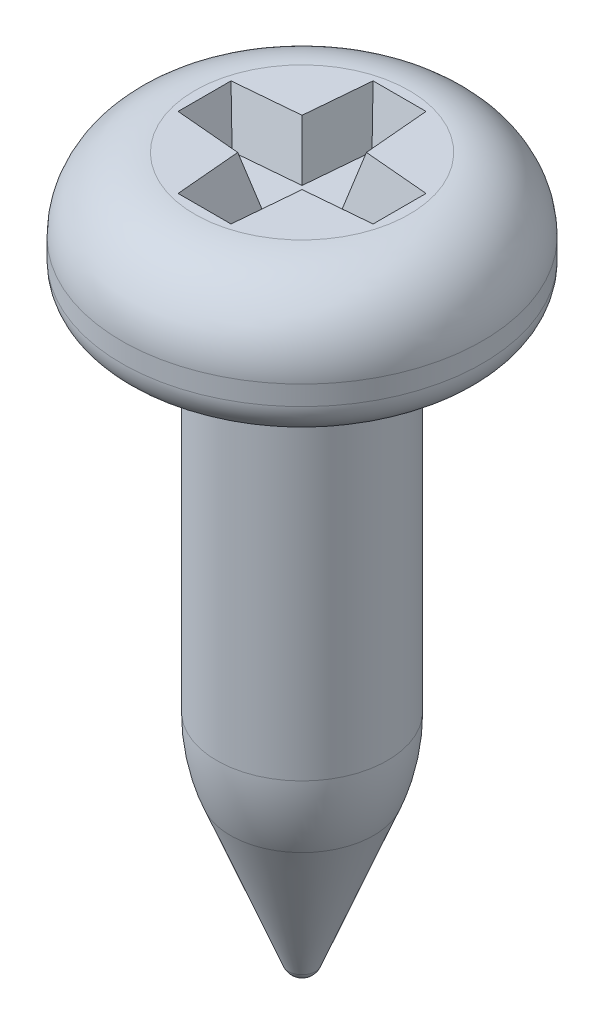
ISO-10303-21;
HEADER;
FILE_DESCRIPTION(('STEP AP214'),'2;1');
FILE_NAME('part.step','',(''),(''),'','','');
FILE_SCHEMA(('AUTOMOTIVE_DESIGN { 1 0 10303 214 1 1 1 1 }'));
ENDSEC;
DATA;
#1=APPLICATION_CONTEXT('core data for automotive mechanical design processes');
#2=APPLICATION_PROTOCOL_DEFINITION('international standard','automotive_design',2000,#1);
#3=PRODUCT_CONTEXT('',#1,'mechanical');
#4=PRODUCT('Part','Part','',(#3));
#5=PRODUCT_RELATED_PRODUCT_CATEGORY('part','',(#4));
#6=PRODUCT_DEFINITION_FORMATION('','',#4);
#7=PRODUCT_DEFINITION_CONTEXT('part definition',#1,'design');
#8=PRODUCT_DEFINITION('design','',#6,#7);
#9=PRODUCT_DEFINITION_SHAPE('','',#8);
#10=(LENGTH_UNIT() NAMED_UNIT(*) SI_UNIT(.MILLI.,.METRE.));
#11=(NAMED_UNIT(*) PLANE_ANGLE_UNIT() SI_UNIT($,.RADIAN.));
#12=(NAMED_UNIT(*) SI_UNIT($,.STERADIAN.) SOLID_ANGLE_UNIT());
#13=UNCERTAINTY_MEASURE_WITH_UNIT(LENGTH_MEASURE(1.E-05),#10,'distance_accuracy_value','');
#14=(GEOMETRIC_REPRESENTATION_CONTEXT(3) GLOBAL_UNCERTAINTY_ASSIGNED_CONTEXT((#13)) GLOBAL_UNIT_ASSIGNED_CONTEXT((#10,
#11,#12)) REPRESENTATION_CONTEXT('',''));
#15=CARTESIAN_POINT('',(0.,0.,0.));
#16=DIRECTION('',(0.,0.,1.));
#17=DIRECTION('',(1.,0.,0.));
#18=AXIS2_PLACEMENT_3D('',#15,#16,#17);
#19=CARTESIAN_POINT('',(1.1,0.,0.));
#20=DIRECTION('',(0.,-1.,0.));
#21=DIRECTION('',(1.,0.,0.));
#22=AXIS2_PLACEMENT_3D('',#19,#20,#21);
#23=PLANE('',#22);
#24=DIRECTION('',(-1.,0.,0.));
#25=VECTOR('',#24,1.);
#26=CARTESIAN_POINT('',(-0.271382595437633,0.,-1.));
#27=LINE('',#26,#25);
#28=CARTESIAN_POINT('',(0.271382595437633,0.,-1.));
#29=VERTEX_POINT('',#28);
#30=CARTESIAN_POINT('',(-0.271382595437633,0.,-1.));
#31=VERTEX_POINT('',#30);
#32=EDGE_CURVE('E139',#29,#31,#27,.T.);
#33=ORIENTED_EDGE('',*,*,#32,.F.);
#34=DIRECTION('',(-0.0871557427476548,0.,-0.996194698091746));
#35=VECTOR('',#34,1.);
#36=CARTESIAN_POINT('',(0.271382595437633,0.,-1.));
#37=LINE('',#36,#35);
#38=CARTESIAN_POINT('',(0.33,0.,-0.33));
#39=VERTEX_POINT('',#38);
#40=EDGE_CURVE('E47',#39,#29,#37,.T.);
#41=ORIENTED_EDGE('',*,*,#40,.F.);
#42=DIRECTION('',(-0.996194698091746,0.,-0.0871557427476548));
#43=VECTOR('',#42,1.);
#44=CARTESIAN_POINT('',(0.33,0.,-0.33));
#45=LINE('',#44,#43);
#46=CARTESIAN_POINT('',(1.,0.,-0.271382595437633));
#47=VERTEX_POINT('',#46);
#48=EDGE_CURVE('E171',#47,#39,#45,.T.);
#49=ORIENTED_EDGE('',*,*,#48,.F.);
#50=DIRECTION('',(0.,0.,-1.));
#51=VECTOR('',#50,1.);
#52=CARTESIAN_POINT('',(1.,0.,-0.271382595437633));
#53=LINE('',#52,#51);
#54=CARTESIAN_POINT('',(1.,0.,0.271382595437633));
#55=VERTEX_POINT('',#54);
#56=EDGE_CURVE('E169',#55,#47,#53,.T.);
#57=ORIENTED_EDGE('',*,*,#56,.F.);
#58=DIRECTION('',(0.996194698091746,0.,-0.0871557427476548));
#59=VECTOR('',#58,1.);
#60=CARTESIAN_POINT('',(0.33,0.,0.33));
#61=LINE('',#60,#59);
#62=CARTESIAN_POINT('',(0.33,0.,0.33));
#63=VERTEX_POINT('',#62);
#64=EDGE_CURVE('E166',#63,#55,#61,.T.);
#65=ORIENTED_EDGE('',*,*,#64,.F.);
#66=DIRECTION('',(0.0871557427476548,0.,-0.996194698091746));
#67=VECTOR('',#66,1.);
#68=CARTESIAN_POINT('',(0.271382595437633,0.,1.));
#69=LINE('',#68,#67);
#70=CARTESIAN_POINT('',(0.271382595437633,0.,1.));
#71=VERTEX_POINT('',#70);
#72=EDGE_CURVE('E163',#71,#63,#69,.T.);
#73=ORIENTED_EDGE('',*,*,#72,.F.);
#74=DIRECTION('',(1.,0.,0.));
#75=VECTOR('',#74,1.);
#76=CARTESIAN_POINT('',(-0.271382595437633,0.,1.));
#77=LINE('',#76,#75);
#78=CARTESIAN_POINT('',(-0.271382595437633,0.,1.));
#79=VERTEX_POINT('',#78);
#80=EDGE_CURVE('E160',#79,#71,#77,.T.);
#81=ORIENTED_EDGE('',*,*,#80,.F.);
#82=DIRECTION('',(0.0871557427476548,0.,0.996194698091746));
#83=VECTOR('',#82,1.);
#84=CARTESIAN_POINT('',(-0.271382595437633,0.,1.));
#85=LINE('',#84,#83);
#86=CARTESIAN_POINT('',(-0.33,0.,0.33));
#87=VERTEX_POINT('',#86);
#88=EDGE_CURVE('E157',#87,#79,#85,.T.);
#89=ORIENTED_EDGE('',*,*,#88,.F.);
#90=DIRECTION('',(0.996194698091746,0.,0.0871557427476548));
#91=VECTOR('',#90,1.);
#92=CARTESIAN_POINT('',(-0.33,0.,0.33));
#93=LINE('',#92,#91);
#94=CARTESIAN_POINT('',(-1.,0.,0.271382595437633));
#95=VERTEX_POINT('',#94);
#96=EDGE_CURVE('E154',#95,#87,#93,.T.);
#97=ORIENTED_EDGE('',*,*,#96,.F.);
#98=DIRECTION('',(0.,0.,1.));
#99=VECTOR('',#98,1.);
#100=CARTESIAN_POINT('',(-1.,0.,-0.271382595437633));
#101=LINE('',#100,#99);
#102=CARTESIAN_POINT('',(-1.,0.,-0.271382595437633));
#103=VERTEX_POINT('',#102);
#104=EDGE_CURVE('E148',#103,#95,#101,.T.);
#105=ORIENTED_EDGE('',*,*,#104,.F.);
#106=DIRECTION('',(-0.996194698091746,0.,0.0871557427476548));
#107=VECTOR('',#106,1.);
#108=CARTESIAN_POINT('',(-0.33,0.,-0.33));
#109=LINE('',#108,#107);
#110=CARTESIAN_POINT('',(-0.33,0.,-0.33));
#111=VERTEX_POINT('',#110);
#112=EDGE_CURVE('E146',#111,#103,#109,.T.);
#113=ORIENTED_EDGE('',*,*,#112,.F.);
#114=DIRECTION('',(-0.0871557427476548,0.,0.996194698091746));
#115=VECTOR('',#114,1.);
#116=CARTESIAN_POINT('',(-0.271382595437633,0.,-1.));
#117=LINE('',#116,#115);
#118=EDGE_CURVE('E130',#31,#111,#117,.T.);
#119=ORIENTED_EDGE('',*,*,#118,.F.);
#120=EDGE_LOOP('',(#33,#41,#49,#57,#65,#73,#81,#89,#97,#105,#113,#119));
#121=FACE_BOUND('',#120,.T.);
#122=CARTESIAN_POINT('',(0.,0.,0.));
#123=DIRECTION('',(0.,1.,0.));
#124=DIRECTION('',(-1.,0.,0.));
#125=AXIS2_PLACEMENT_3D('',#122,#123,#124);
#126=CIRCLE('',#125,1.1);
#127=CARTESIAN_POINT('',(-1.1,0.,0.));
#128=VERTEX_POINT('',#127);
#129=EDGE_CURVE('E11',#128,#128,#126,.T.);
#130=ORIENTED_EDGE('',*,*,#129,.T.);
#131=EDGE_LOOP('',(#130));
#132=FACE_BOUND('',#131,.T.);
#133=ADVANCED_FACE('F33',(#121,#132),#23,.F.);
#134=CARTESIAN_POINT('',(0.,-0.75,0.));
#135=DIRECTION('',(0.,1.,0.));
#136=DIRECTION('',(-1.,0.,0.));
#137=AXIS2_PLACEMENT_3D('',#134,#135,#136);
#138=TOROIDAL_SURFACE('',#137,1.1,0.75);
#139=ORIENTED_EDGE('',*,*,#129,.F.);
#140=EDGE_LOOP('',(#139));
#141=FACE_BOUND('',#140,.T.);
#142=CARTESIAN_POINT('',(0.,-0.75,0.));
#143=DIRECTION('',(0.,1.,0.));
#144=DIRECTION('',(-1.,0.,0.));
#145=AXIS2_PLACEMENT_3D('',#142,#143,#144);
#146=CIRCLE('',#145,1.85);
#147=CARTESIAN_POINT('',(-1.85,-0.750000000000001,0.));
#148=VERTEX_POINT('',#147);
#149=EDGE_CURVE('E40',#148,#148,#146,.T.);
#150=ORIENTED_EDGE('',*,*,#149,.T.);
#151=EDGE_LOOP('',(#150));
#152=FACE_BOUND('',#151,.T.);
#153=ADVANCED_FACE('F247',(#141,#152),#138,.T.);
#154=CARTESIAN_POINT('',(0.,0.,0.));
#155=DIRECTION('',(0.,1.,0.));
#156=DIRECTION('',(-1.,0.,0.));
#157=AXIS2_PLACEMENT_3D('',#154,#155,#156);
#158=CYLINDRICAL_SURFACE('',#157,1.85);
#159=ORIENTED_EDGE('',*,*,#149,.F.);
#160=EDGE_LOOP('',(#159));
#161=FACE_BOUND('',#160,.T.);
#162=CARTESIAN_POINT('',(0.,-0.95,0.));
#163=DIRECTION('',(0.,1.,0.));
#164=DIRECTION('',(-1.,0.,0.));
#165=AXIS2_PLACEMENT_3D('',#162,#163,#164);
#166=CIRCLE('',#165,1.85);
#167=CARTESIAN_POINT('',(-1.85,-0.950000000000001,0.));
#168=VERTEX_POINT('',#167);
#169=EDGE_CURVE('E242',#168,#168,#166,.T.);
#170=ORIENTED_EDGE('',*,*,#169,.T.);
#171=EDGE_LOOP('',(#170));
#172=FACE_BOUND('',#171,.T.);
#173=ADVANCED_FACE('F249',(#161,#172),#158,.T.);
#174=CARTESIAN_POINT('',(0.,-0.95,0.));
#175=DIRECTION('',(0.,1.,0.));
#176=DIRECTION('',(-1.,0.,0.));
#177=AXIS2_PLACEMENT_3D('',#174,#175,#176);
#178=TOROIDAL_SURFACE('',#177,1.5,0.35);
#179=ORIENTED_EDGE('',*,*,#169,.F.);
#180=EDGE_LOOP('',(#179));
#181=FACE_BOUND('',#180,.T.);
#182=CARTESIAN_POINT('',(0.,-1.3,0.));
#183=DIRECTION('',(0.,1.,0.));
#184=DIRECTION('',(-1.,0.,0.));
#185=AXIS2_PLACEMENT_3D('',#182,#183,#184);
#186=CIRCLE('',#185,1.5);
#187=CARTESIAN_POINT('',(-1.5,-1.3,0.));
#188=VERTEX_POINT('',#187);
#189=EDGE_CURVE('E239',#188,#188,#186,.T.);
#190=ORIENTED_EDGE('',*,*,#189,.T.);
#191=EDGE_LOOP('',(#190));
#192=FACE_BOUND('',#191,.T.);
#193=ADVANCED_FACE('F252',(#181,#192),#178,.T.);
#194=CARTESIAN_POINT('',(1.025,-1.3,0.));
#195=DIRECTION('',(0.,1.,0.));
#196=DIRECTION('',(-1.,0.,0.));
#197=AXIS2_PLACEMENT_3D('',#194,#195,#196);
#198=PLANE('',#197);
#199=ORIENTED_EDGE('',*,*,#189,.F.);
#200=EDGE_LOOP('',(#199));
#201=FACE_BOUND('',#200,.T.);
#202=CARTESIAN_POINT('',(0.,-1.3,0.));
#203=DIRECTION('',(0.,1.,0.));
#204=DIRECTION('',(-1.,0.,0.));
#205=AXIS2_PLACEMENT_3D('',#202,#203,#204);
#206=CIRCLE('',#205,1.025);
#207=CARTESIAN_POINT('',(-1.025,-1.3,0.));
#208=VERTEX_POINT('',#207);
#209=EDGE_CURVE('E236',#208,#208,#206,.T.);
#210=ORIENTED_EDGE('',*,*,#209,.T.);
#211=EDGE_LOOP('',(#210));
#212=FACE_BOUND('',#211,.T.);
#213=ADVANCED_FACE('F258',(#201,#212),#198,.F.);
#214=CARTESIAN_POINT('',(0.,-1.45,0.));
#215=DIRECTION('',(0.,1.,0.));
#216=DIRECTION('',(-1.,0.,0.));
#217=AXIS2_PLACEMENT_3D('',#214,#215,#216);
#218=TOROIDAL_SURFACE('',#217,1.025,0.15);
#219=ORIENTED_EDGE('',*,*,#209,.F.);
#220=EDGE_LOOP('',(#219));
#221=FACE_BOUND('',#220,.T.);
#222=CARTESIAN_POINT('',(0.,-1.45,0.));
#223=DIRECTION('',(0.,1.,0.));
#224=DIRECTION('',(-1.,0.,0.));
#225=AXIS2_PLACEMENT_3D('',#222,#223,#224);
#226=CIRCLE('',#225,0.874999999999999);
#227=CARTESIAN_POINT('',(-0.874999999999999,-1.45,0.));
#228=VERTEX_POINT('',#227);
#229=EDGE_CURVE('E233',#228,#228,#226,.T.);
#230=ORIENTED_EDGE('',*,*,#229,.T.);
#231=EDGE_LOOP('',(#230));
#232=FACE_BOUND('',#231,.T.);
#233=ADVANCED_FACE('F264',(#221,#232),#218,.F.);
#234=CARTESIAN_POINT('',(0.,0.,0.));
#235=DIRECTION('',(0.,1.,0.));
#236=DIRECTION('',(-1.,0.,0.));
#237=AXIS2_PLACEMENT_3D('',#234,#235,#236);
#238=CYLINDRICAL_SURFACE('',#237,0.875);
#239=ORIENTED_EDGE('',*,*,#229,.F.);
#240=EDGE_LOOP('',(#239));
#241=FACE_BOUND('',#240,.T.);
#242=CARTESIAN_POINT('',(0.,-4.96440542344636,0.));
#243=DIRECTION('',(0.,1.,0.));
#244=DIRECTION('',(-1.,0.,0.));
#245=AXIS2_PLACEMENT_3D('',#242,#243,#244);
#246=CIRCLE('',#245,0.875);
#247=CARTESIAN_POINT('',(-0.874999999999999,-4.96440542344636,0.));
#248=VERTEX_POINT('',#247);
#249=EDGE_CURVE('E230',#248,#248,#246,.T.);
#250=ORIENTED_EDGE('',*,*,#249,.T.);
#251=EDGE_LOOP('',(#250));
#252=FACE_BOUND('',#251,.T.);
#253=ADVANCED_FACE('F270',(#241,#252),#238,.T.);
#254=CARTESIAN_POINT('',(0.,-4.96440542344636,0.));
#255=DIRECTION('',(0.,1.,0.));
#256=DIRECTION('',(-1.,0.,0.));
#257=AXIS2_PLACEMENT_3D('',#254,#255,#256);
#258=DEGENERATE_TOROIDAL_SURFACE('',#257,1.125,2.,.F.);
#259=ORIENTED_EDGE('',*,*,#249,.F.);
#260=EDGE_LOOP('',(#259));
#261=FACE_BOUND('',#260,.T.);
#262=CARTESIAN_POINT('',(0.,-5.7,0.));
#263=DIRECTION('',(0.,1.,0.));
#264=DIRECTION('',(-1.,0.,0.));
#265=AXIS2_PLACEMENT_3D('',#262,#263,#264);
#266=CIRCLE('',#265,0.73481198483741);
#267=CARTESIAN_POINT('',(-0.734811984837409,-5.7,0.));
#268=VERTEX_POINT('',#267);
#269=EDGE_CURVE('E227',#268,#268,#266,.T.);
#270=ORIENTED_EDGE('',*,*,#269,.T.);
#271=EDGE_LOOP('',(#270));
#272=FACE_BOUND('',#271,.T.);
#273=ADVANCED_FACE('F276',(#261,#272),#258,.F.);
#274=CARTESIAN_POINT('',(0.,-7.20516959324152,0.));
#275=DIRECTION('',(0.,1.,0.));
#276=DIRECTION('',(-1.,0.,0.));
#277=AXIS2_PLACEMENT_3D('',#274,#275,#276);
#278=CONICAL_SURFACE('',#277,0.139485898862805,0.376639161138822);
#279=ORIENTED_EDGE('',*,*,#269,.F.);
#280=EDGE_LOOP('',(#279));
#281=FACE_BOUND('',#280,.T.);
#282=CARTESIAN_POINT('',(0.,-7.20516959324152,0.));
#283=DIRECTION('',(0.,1.,0.));
#284=DIRECTION('',(-1.,0.,0.));
#285=AXIS2_PLACEMENT_3D('',#282,#283,#284);
#286=CIRCLE('',#285,0.139485898862805);
#287=CARTESIAN_POINT('',(-0.139485898862804,-7.20516959324152,0.));
#288=VERTEX_POINT('',#287);
#289=EDGE_CURVE('E175',#288,#288,#286,.T.);
#290=ORIENTED_EDGE('',*,*,#289,.T.);
#291=EDGE_LOOP('',(#290));
#292=FACE_BOUND('',#291,.T.);
#293=ADVANCED_FACE('F282',(#281,#292),#278,.T.);
#294=CARTESIAN_POINT('',(0.,-7.15,0.));
#295=DIRECTION('',(0.,1.,0.));
#296=DIRECTION('',(-1.,0.,0.));
#297=AXIS2_PLACEMENT_3D('',#294,#295,#296);
#298=SPHERICAL_SURFACE('',#297,0.149999999999999);
#299=ORIENTED_EDGE('',*,*,#289,.F.);
#300=EDGE_LOOP('',(#299));
#301=FACE_BOUND('',#300,.T.);
#302=ADVANCED_FACE('F288',(#301),#298,.T.);
#303=CARTESIAN_POINT('',(0.271382595437633,0.,-1.));
#304=DIRECTION('',(0.962250186899058,-0.258819045102521,-0.0841859828293659));
#305=DIRECTION('',(0.259741110692871,0.965678287741851,0.));
#306=AXIS2_PLACEMENT_3D('',#303,#304,#305);
#307=PLANE('',#306);
#308=ORIENTED_EDGE('',*,*,#40,.T.);
#309=DIRECTION('',(0.230762906723662,0.939855498552101,-0.251833521838986));
#310=VECTOR('',#309,1.);
#311=CARTESIAN_POINT('',(0.271382595437633,0.,-1.));
#312=LINE('',#311,#310);
#313=CARTESIAN_POINT('',(0.148617496398917,-0.5,-0.866025403784438));
#314=VERTEX_POINT('',#313);
#315=EDGE_CURVE('E90',#314,#29,#312,.T.);
#316=ORIENTED_EDGE('',*,*,#315,.F.);
#317=DIRECTION('',(-0.0871557427476548,0.,-0.996194698091746));
#318=VECTOR('',#317,1.);
#319=CARTESIAN_POINT('',(0.222680446133132,-0.5,-0.0194820146255435));
#320=LINE('',#319,#318);
#321=CARTESIAN_POINT('',(0.206333094846248,-0.5,-0.206333094846248));
#322=VERTEX_POINT('',#321);
#323=EDGE_CURVE('E173',#322,#314,#320,.T.);
#324=ORIENTED_EDGE('',*,*,#323,.F.);
#325=DIRECTION('',(0.233463888260859,0.943922256203466,-0.233463888260859));
#326=VECTOR('',#325,1.);
#327=CARTESIAN_POINT('',(0.363323645043907,0.134731458681192,-0.363323645043907));
#328=LINE('',#327,#326);
#329=EDGE_CURVE('E55',#322,#39,#328,.T.);
#330=ORIENTED_EDGE('',*,*,#329,.T.);
#331=EDGE_LOOP('',(#308,#316,#324,#330));
#332=FACE_BOUND('',#331,.T.);
#333=ADVANCED_FACE('F293',(#332),#307,.F.);
#334=CARTESIAN_POINT('',(0.33,0.,-0.33));
#335=DIRECTION('',(0.0841859828293659,-0.258819045102521,-0.962250186899058));
#336=DIRECTION('',(0.,0.965678287741851,-0.259741110692871));
#337=AXIS2_PLACEMENT_3D('',#334,#335,#336);
#338=PLANE('',#337);
#339=ORIENTED_EDGE('',*,*,#48,.T.);
#340=ORIENTED_EDGE('',*,*,#329,.F.);
#341=DIRECTION('',(-0.996194698091746,0.,-0.0871557427476548));
#342=VECTOR('',#341,1.);
#343=CARTESIAN_POINT('',(0.0194820146255435,-0.5,-0.222680446133132));
#344=LINE('',#343,#342);
#345=CARTESIAN_POINT('',(0.866025403784438,-0.5,-0.148617496398917));
#346=VERTEX_POINT('',#345);
#347=EDGE_CURVE('E176',#346,#322,#344,.T.);
#348=ORIENTED_EDGE('',*,*,#347,.F.);
#349=DIRECTION('',(0.251833521838986,0.939855498552101,-0.230762906723662));
#350=VECTOR('',#349,1.);
#351=CARTESIAN_POINT('',(1.,0.,-0.271382595437633));
#352=LINE('',#351,#350);
#353=EDGE_CURVE('E95',#346,#47,#352,.T.);
#354=ORIENTED_EDGE('',*,*,#353,.T.);
#355=EDGE_LOOP('',(#339,#340,#348,#354));
#356=FACE_BOUND('',#355,.T.);
#357=ADVANCED_FACE('F298',(#356),#338,.F.);
#358=CARTESIAN_POINT('',(1.,0.,-0.271382595437633));
#359=DIRECTION('',(0.965925826289068,-0.258819045102521,0.));
#360=DIRECTION('',(0.258819045102521,0.965925826289068,0.));
#361=AXIS2_PLACEMENT_3D('',#358,#359,#360);
#362=PLANE('',#361);
#363=ORIENTED_EDGE('',*,*,#56,.T.);
#364=ORIENTED_EDGE('',*,*,#353,.F.);
#365=DIRECTION('',(0.,0.,-1.));
#366=VECTOR('',#365,1.);
#367=CARTESIAN_POINT('',(0.866025403784438,-0.5,0.));
#368=LINE('',#367,#366);
#369=CARTESIAN_POINT('',(0.866025403784438,-0.5,0.148617496398917));
#370=VERTEX_POINT('',#369);
#371=EDGE_CURVE('E199',#370,#346,#368,.T.);
#372=ORIENTED_EDGE('',*,*,#371,.F.);
#373=DIRECTION('',(0.251833521838986,0.939855498552101,0.230762906723662));
#374=VECTOR('',#373,1.);
#375=CARTESIAN_POINT('',(0.960914999983138,-0.145867205876761,0.23556779148571));
#376=LINE('',#375,#374);
#377=EDGE_CURVE('E191',#370,#55,#376,.T.);
#378=ORIENTED_EDGE('',*,*,#377,.T.);
#379=EDGE_LOOP('',(#363,#364,#372,#378));
#380=FACE_BOUND('',#379,.T.);
#381=ADVANCED_FACE('F360',(#380),#362,.F.);
#382=CARTESIAN_POINT('',(0.33,0.,0.33));
#383=DIRECTION('',(0.0841859828293659,-0.258819045102521,0.962250186899058));
#384=DIRECTION('',(0.,-0.965678287741851,-0.259741110692871));
#385=AXIS2_PLACEMENT_3D('',#382,#383,#384);
#386=PLANE('',#385);
#387=ORIENTED_EDGE('',*,*,#64,.T.);
#388=ORIENTED_EDGE('',*,*,#377,.F.);
#389=DIRECTION('',(0.996194698091746,0.,-0.0871557427476548));
#390=VECTOR('',#389,1.);
#391=CARTESIAN_POINT('',(0.0194820146255435,-0.5,0.222680446133132));
#392=LINE('',#391,#390);
#393=CARTESIAN_POINT('',(0.206333094846248,-0.5,0.206333094846248));
#394=VERTEX_POINT('',#393);
#395=EDGE_CURVE('E202',#394,#370,#392,.T.);
#396=ORIENTED_EDGE('',*,*,#395,.F.);
#397=DIRECTION('',(0.233463888260859,0.943922256203466,0.233463888260859));
#398=VECTOR('',#397,1.);
#399=CARTESIAN_POINT('',(0.33,0.,0.33));
#400=LINE('',#399,#398);
#401=EDGE_CURVE('E189',#394,#63,#400,.T.);
#402=ORIENTED_EDGE('',*,*,#401,.T.);
#403=EDGE_LOOP('',(#387,#388,#396,#402));
#404=FACE_BOUND('',#403,.T.);
#405=ADVANCED_FACE('F368',(#404),#386,.F.);
#406=CARTESIAN_POINT('',(0.271382595437633,0.,1.));
#407=DIRECTION('',(0.962250186899058,-0.258819045102521,0.0841859828293659));
#408=DIRECTION('',(0.259741110692871,0.965678287741851,0.));
#409=AXIS2_PLACEMENT_3D('',#406,#407,#408);
#410=PLANE('',#409);
#411=ORIENTED_EDGE('',*,*,#72,.T.);
#412=ORIENTED_EDGE('',*,*,#401,.F.);
#413=DIRECTION('',(0.0871557427476548,0.,-0.996194698091746));
#414=VECTOR('',#413,1.);
#415=CARTESIAN_POINT('',(0.222680446133132,-0.5,0.0194820146255435));
#416=LINE('',#415,#414);
#417=CARTESIAN_POINT('',(0.148617496398917,-0.5,0.866025403784438));
#418=VERTEX_POINT('',#417);
#419=EDGE_CURVE('E205',#418,#394,#416,.T.);
#420=ORIENTED_EDGE('',*,*,#419,.F.);
#421=DIRECTION('',(0.230762906723662,0.939855498552101,0.251833521838986));
#422=VECTOR('',#421,1.);
#423=CARTESIAN_POINT('',(0.242479524498311,-0.117716969910997,0.968457832976909));
#424=LINE('',#423,#422);
#425=EDGE_CURVE('E187',#418,#71,#424,.T.);
#426=ORIENTED_EDGE('',*,*,#425,.T.);
#427=EDGE_LOOP('',(#411,#412,#420,#426));
#428=FACE_BOUND('',#427,.T.);
#429=ADVANCED_FACE('F378',(#428),#410,.F.);
#430=CARTESIAN_POINT('',(-0.271382595437633,0.,1.));
#431=DIRECTION('',(0.,-0.258819045102521,0.965925826289068));
#432=DIRECTION('',(0.,-0.965925826289068,-0.258819045102521));
#433=AXIS2_PLACEMENT_3D('',#430,#431,#432);
#434=PLANE('',#433);
#435=ORIENTED_EDGE('',*,*,#80,.T.);
#436=ORIENTED_EDGE('',*,*,#425,.F.);
#437=DIRECTION('',(1.,0.,0.));
#438=VECTOR('',#437,1.);
#439=CARTESIAN_POINT('',(0.,-0.5,0.866025403784438));
#440=LINE('',#439,#438);
#441=CARTESIAN_POINT('',(-0.148617496398917,-0.5,0.866025403784438));
#442=VERTEX_POINT('',#441);
#443=EDGE_CURVE('E208',#442,#418,#440,.T.);
#444=ORIENTED_EDGE('',*,*,#443,.F.);
#445=DIRECTION('',(-0.230762906723662,0.939855498552101,0.251833521838986));
#446=VECTOR('',#445,1.);
#447=CARTESIAN_POINT('',(-0.271382595437633,0.,1.));
#448=LINE('',#447,#446);
#449=EDGE_CURVE('E185',#442,#79,#448,.T.);
#450=ORIENTED_EDGE('',*,*,#449,.T.);
#451=EDGE_LOOP('',(#435,#436,#444,#450));
#452=FACE_BOUND('',#451,.T.);
#453=ADVANCED_FACE('F388',(#452),#434,.F.);
#454=CARTESIAN_POINT('',(-0.271382595437633,0.,1.));
#455=DIRECTION('',(-0.962250186899058,-0.258819045102521,0.0841859828293659));
#456=DIRECTION('',(0.259741110692871,-0.965678287741851,0.));
#457=AXIS2_PLACEMENT_3D('',#454,#455,#456);
#458=PLANE('',#457);
#459=ORIENTED_EDGE('',*,*,#88,.T.);
#460=ORIENTED_EDGE('',*,*,#449,.F.);
#461=DIRECTION('',(0.0871557427476548,0.,0.996194698091746));
#462=VECTOR('',#461,1.);
#463=CARTESIAN_POINT('',(-0.222680446133132,-0.5,0.0194820146255435));
#464=LINE('',#463,#462);
#465=CARTESIAN_POINT('',(-0.206333094846248,-0.5,0.206333094846248));
#466=VERTEX_POINT('',#465);
#467=EDGE_CURVE('E211',#466,#442,#464,.T.);
#468=ORIENTED_EDGE('',*,*,#467,.F.);
#469=DIRECTION('',(-0.23346388826086,0.943922256203466,0.233463888260859));
#470=VECTOR('',#469,1.);
#471=CARTESIAN_POINT('',(-0.363323645043907,0.134731458681192,0.363323645043907));
#472=LINE('',#471,#470);
#473=EDGE_CURVE('E183',#466,#87,#472,.T.);
#474=ORIENTED_EDGE('',*,*,#473,.T.);
#475=EDGE_LOOP('',(#459,#460,#468,#474));
#476=FACE_BOUND('',#475,.T.);
#477=ADVANCED_FACE('F398',(#476),#458,.F.);
#478=CARTESIAN_POINT('',(-0.33,0.,0.33));
#479=DIRECTION('',(-0.0841859828293659,-0.258819045102521,0.962250186899058));
#480=DIRECTION('',(0.,-0.965678287741851,-0.259741110692871));
#481=AXIS2_PLACEMENT_3D('',#478,#479,#480);
#482=PLANE('',#481);
#483=ORIENTED_EDGE('',*,*,#96,.T.);
#484=ORIENTED_EDGE('',*,*,#473,.F.);
#485=DIRECTION('',(0.996194698091746,0.,0.0871557427476548));
#486=VECTOR('',#485,1.);
#487=CARTESIAN_POINT('',(-0.0194820146255434,-0.5,0.222680446133132));
#488=LINE('',#487,#486);
#489=CARTESIAN_POINT('',(-0.866025403784438,-0.5,0.148617496398917));
#490=VERTEX_POINT('',#489);
#491=EDGE_CURVE('E214',#490,#466,#488,.T.);
#492=ORIENTED_EDGE('',*,*,#491,.F.);
#493=DIRECTION('',(-0.251833521838987,0.939855498552101,0.230762906723662));
#494=VECTOR('',#493,1.);
#495=CARTESIAN_POINT('',(-0.968457832976909,-0.117716969910997,0.242479524498311));
#496=LINE('',#495,#494);
#497=EDGE_CURVE('E181',#490,#95,#496,.T.);
#498=ORIENTED_EDGE('',*,*,#497,.T.);
#499=EDGE_LOOP('',(#483,#484,#492,#498));
#500=FACE_BOUND('',#499,.T.);
#501=ADVANCED_FACE('F408',(#500),#482,.F.);
#502=CARTESIAN_POINT('',(-1.,0.,-0.271382595437633));
#503=DIRECTION('',(-0.965925826289068,-0.258819045102521,0.));
#504=DIRECTION('',(0.258819045102522,-0.965925826289068,0.));
#505=AXIS2_PLACEMENT_3D('',#502,#503,#504);
#506=PLANE('',#505);
#507=ORIENTED_EDGE('',*,*,#104,.T.);
#508=ORIENTED_EDGE('',*,*,#497,.F.);
#509=DIRECTION('',(0.,0.,1.));
#510=VECTOR('',#509,1.);
#511=CARTESIAN_POINT('',(-0.866025403784438,-0.5,0.));
#512=LINE('',#511,#510);
#513=CARTESIAN_POINT('',(-0.866025403784438,-0.5,-0.148617496398917));
#514=VERTEX_POINT('',#513);
#515=EDGE_CURVE('E217',#514,#490,#512,.T.);
#516=ORIENTED_EDGE('',*,*,#515,.F.);
#517=DIRECTION('',(-0.251833521838987,0.939855498552101,-0.230762906723662));
#518=VECTOR('',#517,1.);
#519=CARTESIAN_POINT('',(-0.960914999983137,-0.145867205876761,-0.23556779148571));
#520=LINE('',#519,#518);
#521=EDGE_CURVE('E179',#514,#103,#520,.T.);
#522=ORIENTED_EDGE('',*,*,#521,.T.);
#523=EDGE_LOOP('',(#507,#508,#516,#522));
#524=FACE_BOUND('',#523,.T.);
#525=ADVANCED_FACE('F418',(#524),#506,.F.);
#526=CARTESIAN_POINT('',(-0.33,0.,-0.33));
#527=DIRECTION('',(-0.0841859828293659,-0.258819045102521,-0.962250186899058));
#528=DIRECTION('',(0.,0.965678287741851,-0.259741110692871));
#529=AXIS2_PLACEMENT_3D('',#526,#527,#528);
#530=PLANE('',#529);
#531=ORIENTED_EDGE('',*,*,#112,.T.);
#532=ORIENTED_EDGE('',*,*,#521,.F.);
#533=DIRECTION('',(-0.996194698091746,0.,0.0871557427476548));
#534=VECTOR('',#533,1.);
#535=CARTESIAN_POINT('',(-0.0194820146255434,-0.5,-0.222680446133132));
#536=LINE('',#535,#534);
#537=CARTESIAN_POINT('',(-0.206333094846248,-0.5,-0.206333094846248));
#538=VERTEX_POINT('',#537);
#539=EDGE_CURVE('E220',#538,#514,#536,.T.);
#540=ORIENTED_EDGE('',*,*,#539,.F.);
#541=DIRECTION('',(-0.23346388826086,0.943922256203466,-0.233463888260859));
#542=VECTOR('',#541,1.);
#543=CARTESIAN_POINT('',(-0.33,0.,-0.33));
#544=LINE('',#543,#542);
#545=EDGE_CURVE('E136',#538,#111,#544,.T.);
#546=ORIENTED_EDGE('',*,*,#545,.T.);
#547=EDGE_LOOP('',(#531,#532,#540,#546));
#548=FACE_BOUND('',#547,.T.);
#549=ADVANCED_FACE('F428',(#548),#530,.F.);
#550=CARTESIAN_POINT('',(-0.271382595437633,0.,-1.));
#551=DIRECTION('',(-0.962250186899058,-0.258819045102521,-0.0841859828293659));
#552=DIRECTION('',(0.259741110692871,-0.965678287741851,0.));
#553=AXIS2_PLACEMENT_3D('',#550,#551,#552);
#554=PLANE('',#553);
#555=ORIENTED_EDGE('',*,*,#118,.T.);
#556=ORIENTED_EDGE('',*,*,#545,.F.);
#557=DIRECTION('',(-0.0871557427476548,0.,0.996194698091746));
#558=VECTOR('',#557,1.);
#559=CARTESIAN_POINT('',(-0.222680446133132,-0.5,-0.0194820146255435));
#560=LINE('',#559,#558);
#561=CARTESIAN_POINT('',(-0.148617496398917,-0.5,-0.866025403784438));
#562=VERTEX_POINT('',#561);
#563=EDGE_CURVE('E133',#562,#538,#560,.T.);
#564=ORIENTED_EDGE('',*,*,#563,.F.);
#565=DIRECTION('',(-0.230762906723662,0.939855498552101,-0.251833521838986));
#566=VECTOR('',#565,1.);
#567=CARTESIAN_POINT('',(-0.271382595437633,0.,-1.));
#568=LINE('',#567,#566);
#569=EDGE_CURVE('E126',#562,#31,#568,.T.);
#570=ORIENTED_EDGE('',*,*,#569,.T.);
#571=EDGE_LOOP('',(#555,#556,#564,#570));
#572=FACE_BOUND('',#571,.T.);
#573=ADVANCED_FACE('F128',(#572),#554,.F.);
#574=CARTESIAN_POINT('',(-0.271382595437633,0.,-1.));
#575=DIRECTION('',(0.,-0.258819045102521,-0.965925826289068));
#576=DIRECTION('',(0.,0.965925826289068,-0.258819045102521));
#577=AXIS2_PLACEMENT_3D('',#574,#575,#576);
#578=PLANE('',#577);
#579=ORIENTED_EDGE('',*,*,#32,.T.);
#580=ORIENTED_EDGE('',*,*,#569,.F.);
#581=DIRECTION('',(-1.,0.,0.));
#582=VECTOR('',#581,1.);
#583=CARTESIAN_POINT('',(0.,-0.5,-0.866025403784438));
#584=LINE('',#583,#582);
#585=EDGE_CURVE('E196',#314,#562,#584,.T.);
#586=ORIENTED_EDGE('',*,*,#585,.F.);
#587=ORIENTED_EDGE('',*,*,#315,.T.);
#588=EDGE_LOOP('',(#579,#580,#586,#587));
#589=FACE_BOUND('',#588,.T.);
#590=ADVANCED_FACE('F140',(#589),#578,.F.);
#591=CARTESIAN_POINT('',(0.,-0.5,0.));
#592=DIRECTION('',(0.,1.,0.));
#593=DIRECTION('',(-1.,0.,0.));
#594=AXIS2_PLACEMENT_3D('',#591,#592,#593);
#595=PLANE('',#594);
#596=ORIENTED_EDGE('',*,*,#323,.T.);
#597=ORIENTED_EDGE('',*,*,#585,.T.);
#598=ORIENTED_EDGE('',*,*,#563,.T.);
#599=ORIENTED_EDGE('',*,*,#539,.T.);
#600=ORIENTED_EDGE('',*,*,#515,.T.);
#601=ORIENTED_EDGE('',*,*,#491,.T.);
#602=ORIENTED_EDGE('',*,*,#467,.T.);
#603=ORIENTED_EDGE('',*,*,#443,.T.);
#604=ORIENTED_EDGE('',*,*,#419,.T.);
#605=ORIENTED_EDGE('',*,*,#395,.T.);
#606=ORIENTED_EDGE('',*,*,#371,.T.);
#607=ORIENTED_EDGE('',*,*,#347,.T.);
#608=EDGE_LOOP('',(#596,#597,#598,#599,#600,#601,#602,#603,#604,#605,#606,#607));
#609=FACE_BOUND('',#608,.T.);
#610=ADVANCED_FACE('F455',(#609),#595,.T.);
#611=CLOSED_SHELL('',(#133,#153,#173,#193,#213,#233,#253,#273,#293,#302,#333,#357,#381,#405,
#429,#453,#477,#501,#525,#549,#573,#590,#610));
#612=MANIFOLD_SOLID_BREP('B2',#611);
#613=ADVANCED_BREP_SHAPE_REPRESENTATION('',(#18,#612),#14);
#614=SHAPE_DEFINITION_REPRESENTATION(#9,#613);
ENDSEC;
END-ISO-10303-21;
